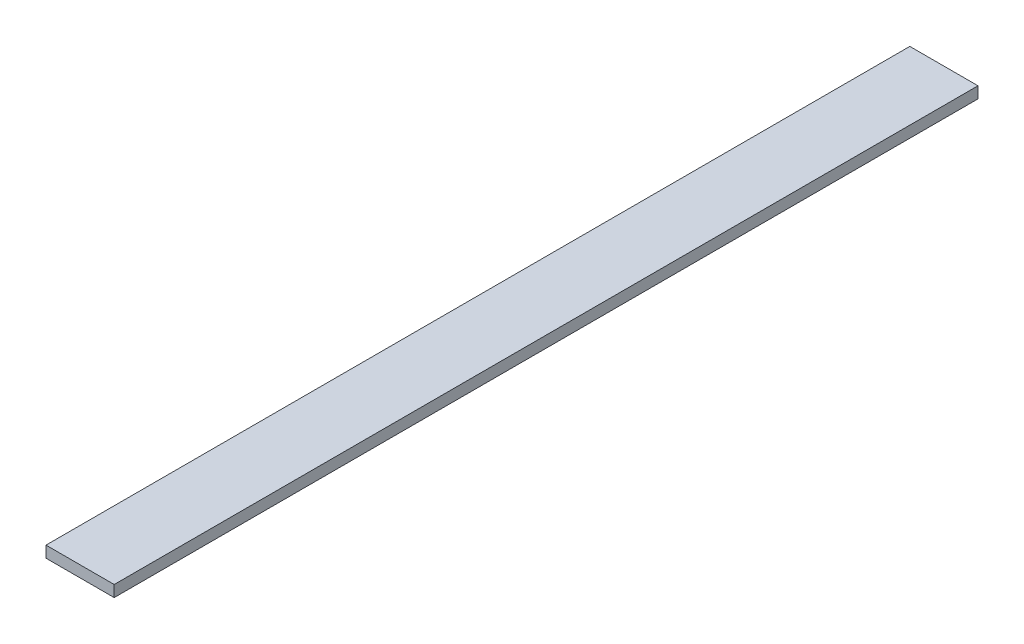
ISO-10303-21;
HEADER;
FILE_DESCRIPTION(('STEP AP214'),'2;1');
FILE_NAME('part.step','',(''),(''),'','','');
FILE_SCHEMA(('AUTOMOTIVE_DESIGN { 1 0 10303 214 1 1 1 1 }'));
ENDSEC;
DATA;
#1=APPLICATION_CONTEXT('core data for automotive mechanical design processes');
#2=APPLICATION_PROTOCOL_DEFINITION('international standard','automotive_design',2000,#1);
#3=PRODUCT_CONTEXT('',#1,'mechanical');
#4=PRODUCT('Part','Part','',(#3));
#5=PRODUCT_RELATED_PRODUCT_CATEGORY('part','',(#4));
#6=PRODUCT_DEFINITION_FORMATION('','',#4);
#7=PRODUCT_DEFINITION_CONTEXT('part definition',#1,'design');
#8=PRODUCT_DEFINITION('design','',#6,#7);
#9=PRODUCT_DEFINITION_SHAPE('','',#8);
#10=(LENGTH_UNIT() NAMED_UNIT(*) SI_UNIT(.MILLI.,.METRE.));
#11=(NAMED_UNIT(*) PLANE_ANGLE_UNIT() SI_UNIT($,.RADIAN.));
#12=(NAMED_UNIT(*) SI_UNIT($,.STERADIAN.) SOLID_ANGLE_UNIT());
#13=UNCERTAINTY_MEASURE_WITH_UNIT(LENGTH_MEASURE(1.E-05),#10,'distance_accuracy_value','');
#14=(GEOMETRIC_REPRESENTATION_CONTEXT(3) GLOBAL_UNCERTAINTY_ASSIGNED_CONTEXT((#13)) GLOBAL_UNIT_ASSIGNED_CONTEXT((#10,
#11,#12)) REPRESENTATION_CONTEXT('',''));
#15=CARTESIAN_POINT('',(0.,0.,0.));
#16=DIRECTION('',(0.,0.,1.));
#17=DIRECTION('',(1.,0.,0.));
#18=AXIS2_PLACEMENT_3D('',#15,#16,#17);
#19=CARTESIAN_POINT('',(0.,0.,241.3));
#20=DIRECTION('',(1.,0.,0.));
#21=DIRECTION('',(0.,0.,-1.));
#22=AXIS2_PLACEMENT_3D('',#19,#20,#21);
#23=PLANE('',#22);
#24=DIRECTION('',(0.,-1.,0.));
#25=VECTOR('',#24,1.);
#26=CARTESIAN_POINT('',(0.,0.,0.));
#27=LINE('',#26,#25);
#28=CARTESIAN_POINT('',(0.,3.175,0.));
#29=VERTEX_POINT('',#28);
#30=CARTESIAN_POINT('',(0.,0.,0.));
#31=VERTEX_POINT('',#30);
#32=EDGE_CURVE('E99',#29,#31,#27,.T.);
#33=ORIENTED_EDGE('',*,*,#32,.T.);
#34=DIRECTION('',(0.,0.,-1.));
#35=VECTOR('',#34,1.);
#36=CARTESIAN_POINT('',(0.,0.,241.3));
#37=LINE('',#36,#35);
#38=CARTESIAN_POINT('',(0.,0.,241.3));
#39=VERTEX_POINT('',#38);
#40=EDGE_CURVE('E11',#39,#31,#37,.T.);
#41=ORIENTED_EDGE('',*,*,#40,.F.);
#42=DIRECTION('',(0.,-1.,0.));
#43=VECTOR('',#42,1.);
#44=CARTESIAN_POINT('',(0.,0.,241.3));
#45=LINE('',#44,#43);
#46=CARTESIAN_POINT('',(0.,3.175,241.3));
#47=VERTEX_POINT('',#46);
#48=EDGE_CURVE('E87',#47,#39,#45,.T.);
#49=ORIENTED_EDGE('',*,*,#48,.F.);
#50=DIRECTION('',(0.,0.,-1.));
#51=VECTOR('',#50,1.);
#52=CARTESIAN_POINT('',(0.,3.175,241.3));
#53=LINE('',#52,#51);
#54=EDGE_CURVE('E95',#47,#29,#53,.T.);
#55=ORIENTED_EDGE('',*,*,#54,.T.);
#56=EDGE_LOOP('',(#33,#41,#49,#55));
#57=FACE_BOUND('',#56,.T.);
#58=ADVANCED_FACE('F36',(#57),#23,.F.);
#59=CARTESIAN_POINT('',(0.,0.,241.3));
#60=DIRECTION('',(0.,1.,0.));
#61=DIRECTION('',(0.,0.,1.));
#62=AXIS2_PLACEMENT_3D('',#59,#60,#61);
#63=PLANE('',#62);
#64=DIRECTION('',(1.,0.,0.));
#65=VECTOR('',#64,1.);
#66=CARTESIAN_POINT('',(0.,0.,0.));
#67=LINE('',#66,#65);
#68=CARTESIAN_POINT('',(19.05,0.,0.));
#69=VERTEX_POINT('',#68);
#70=EDGE_CURVE('E91',#31,#69,#67,.T.);
#71=ORIENTED_EDGE('',*,*,#70,.T.);
#72=DIRECTION('',(0.,0.,-1.));
#73=VECTOR('',#72,1.);
#74=CARTESIAN_POINT('',(19.05,0.,241.3));
#75=LINE('',#74,#73);
#76=CARTESIAN_POINT('',(19.05,0.,241.3));
#77=VERTEX_POINT('',#76);
#78=EDGE_CURVE('E44',#77,#69,#75,.T.);
#79=ORIENTED_EDGE('',*,*,#78,.F.);
#80=DIRECTION('',(1.,0.,0.));
#81=VECTOR('',#80,1.);
#82=CARTESIAN_POINT('',(0.,0.,241.3));
#83=LINE('',#82,#81);
#84=EDGE_CURVE('E82',#39,#77,#83,.T.);
#85=ORIENTED_EDGE('',*,*,#84,.F.);
#86=ORIENTED_EDGE('',*,*,#40,.T.);
#87=EDGE_LOOP('',(#71,#79,#85,#86));
#88=FACE_BOUND('',#87,.T.);
#89=ADVANCED_FACE('F90',(#88),#63,.F.);
#90=CARTESIAN_POINT('',(19.05,0.,241.3));
#91=DIRECTION('',(-1.,0.,0.));
#92=DIRECTION('',(0.,0.,1.));
#93=AXIS2_PLACEMENT_3D('',#90,#91,#92);
#94=PLANE('',#93);
#95=DIRECTION('',(0.,1.,0.));
#96=VECTOR('',#95,1.);
#97=CARTESIAN_POINT('',(19.05,0.,0.));
#98=LINE('',#97,#96);
#99=CARTESIAN_POINT('',(19.05,3.175,0.));
#100=VERTEX_POINT('',#99);
#101=EDGE_CURVE('E69',#69,#100,#98,.T.);
#102=ORIENTED_EDGE('',*,*,#101,.T.);
#103=DIRECTION('',(0.,0.,-1.));
#104=VECTOR('',#103,1.);
#105=CARTESIAN_POINT('',(19.05,3.175,241.3));
#106=LINE('',#105,#104);
#107=CARTESIAN_POINT('',(19.05,3.175,241.3));
#108=VERTEX_POINT('',#107);
#109=EDGE_CURVE('E92',#108,#100,#106,.T.);
#110=ORIENTED_EDGE('',*,*,#109,.F.);
#111=DIRECTION('',(0.,1.,0.));
#112=VECTOR('',#111,1.);
#113=CARTESIAN_POINT('',(19.05,0.,241.3));
#114=LINE('',#113,#112);
#115=EDGE_CURVE('E85',#77,#108,#114,.T.);
#116=ORIENTED_EDGE('',*,*,#115,.F.);
#117=ORIENTED_EDGE('',*,*,#78,.T.);
#118=EDGE_LOOP('',(#102,#110,#116,#117));
#119=FACE_BOUND('',#118,.T.);
#120=ADVANCED_FACE('F93',(#119),#94,.F.);
#121=CARTESIAN_POINT('',(0.,3.175,241.3));
#122=DIRECTION('',(0.,-1.,0.));
#123=DIRECTION('',(0.,0.,-1.));
#124=AXIS2_PLACEMENT_3D('',#121,#122,#123);
#125=PLANE('',#124);
#126=DIRECTION('',(-1.,0.,0.));
#127=VECTOR('',#126,1.);
#128=CARTESIAN_POINT('',(0.,3.175,0.));
#129=LINE('',#128,#127);
#130=EDGE_CURVE('E75',#100,#29,#129,.T.);
#131=ORIENTED_EDGE('',*,*,#130,.T.);
#132=ORIENTED_EDGE('',*,*,#54,.F.);
#133=DIRECTION('',(-1.,0.,0.));
#134=VECTOR('',#133,1.);
#135=CARTESIAN_POINT('',(0.,3.175,241.3));
#136=LINE('',#135,#134);
#137=EDGE_CURVE('E52',#108,#47,#136,.T.);
#138=ORIENTED_EDGE('',*,*,#137,.F.);
#139=ORIENTED_EDGE('',*,*,#109,.T.);
#140=EDGE_LOOP('',(#131,#132,#138,#139));
#141=FACE_BOUND('',#140,.T.);
#142=ADVANCED_FACE('F106',(#141),#125,.F.);
#143=CARTESIAN_POINT('',(0.,0.,241.3));
#144=DIRECTION('',(0.,0.,-1.));
#145=DIRECTION('',(-1.,0.,0.));
#146=AXIS2_PLACEMENT_3D('',#143,#144,#145);
#147=PLANE('',#146);
#148=ORIENTED_EDGE('',*,*,#48,.T.);
#149=ORIENTED_EDGE('',*,*,#84,.T.);
#150=ORIENTED_EDGE('',*,*,#115,.T.);
#151=ORIENTED_EDGE('',*,*,#137,.T.);
#152=EDGE_LOOP('',(#148,#149,#150,#151));
#153=FACE_BOUND('',#152,.T.);
#154=ADVANCED_FACE('F83',(#153),#147,.F.);
#155=CARTESIAN_POINT('',(0.,0.,0.));
#156=DIRECTION('',(0.,0.,-1.));
#157=DIRECTION('',(-1.,0.,0.));
#158=AXIS2_PLACEMENT_3D('',#155,#156,#157);
#159=PLANE('',#158);
#160=ORIENTED_EDGE('',*,*,#32,.F.);
#161=ORIENTED_EDGE('',*,*,#130,.F.);
#162=ORIENTED_EDGE('',*,*,#101,.F.);
#163=ORIENTED_EDGE('',*,*,#70,.F.);
#164=EDGE_LOOP('',(#160,#161,#162,#163));
#165=FACE_BOUND('',#164,.T.);
#166=ADVANCED_FACE('F109',(#165),#159,.T.);
#167=CLOSED_SHELL('',(#58,#89,#120,#142,#154,#166));
#168=MANIFOLD_SOLID_BREP('B2',#167);
#169=ADVANCED_BREP_SHAPE_REPRESENTATION('',(#18,#168),#14);
#170=SHAPE_DEFINITION_REPRESENTATION(#9,#169);
ENDSEC;
END-ISO-10303-21;
